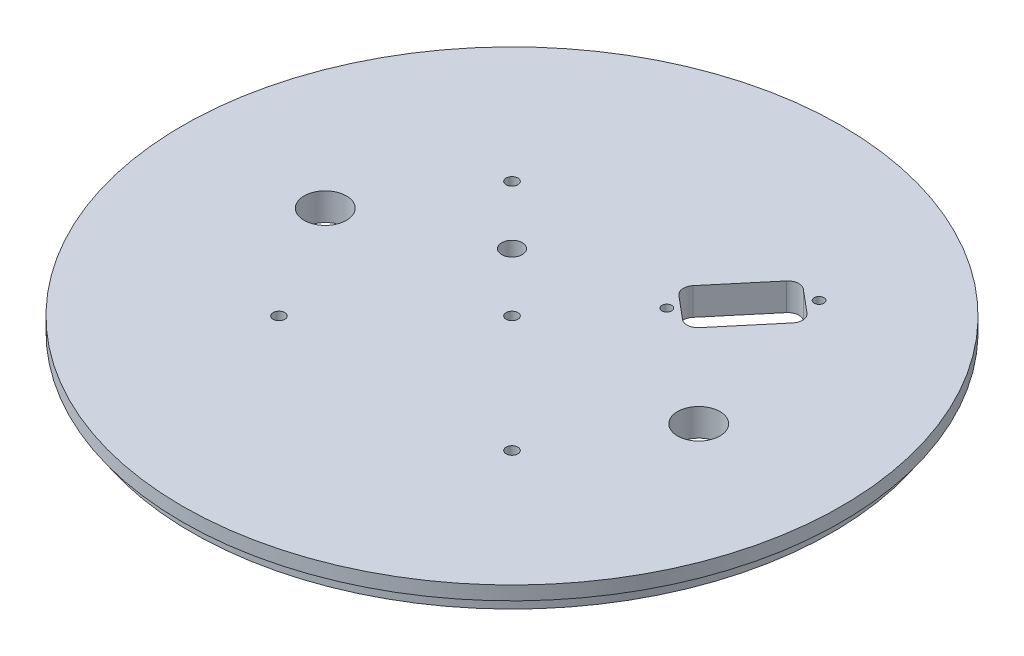
ISO-10303-21;
HEADER;
FILE_DESCRIPTION(('STEP AP214'),'2;1');
FILE_NAME('part.step','',(''),(''),'','','');
FILE_SCHEMA(('AUTOMOTIVE_DESIGN { 1 0 10303 214 1 1 1 1 }'));
ENDSEC;
DATA;
#1=APPLICATION_CONTEXT('core data for automotive mechanical design processes');
#2=APPLICATION_PROTOCOL_DEFINITION('international standard','automotive_design',2000,#1);
#3=PRODUCT_CONTEXT('',#1,'mechanical');
#4=PRODUCT('Part','Part','',(#3));
#5=PRODUCT_RELATED_PRODUCT_CATEGORY('part','',(#4));
#6=PRODUCT_DEFINITION_FORMATION('','',#4);
#7=PRODUCT_DEFINITION_CONTEXT('part definition',#1,'design');
#8=PRODUCT_DEFINITION('design','',#6,#7);
#9=PRODUCT_DEFINITION_SHAPE('','',#8);
#10=(LENGTH_UNIT() NAMED_UNIT(*) SI_UNIT(.MILLI.,.METRE.));
#11=(NAMED_UNIT(*) PLANE_ANGLE_UNIT() SI_UNIT($,.RADIAN.));
#12=(NAMED_UNIT(*) SI_UNIT($,.STERADIAN.) SOLID_ANGLE_UNIT());
#13=UNCERTAINTY_MEASURE_WITH_UNIT(LENGTH_MEASURE(1.E-05),#10,'distance_accuracy_value','');
#14=(GEOMETRIC_REPRESENTATION_CONTEXT(3) GLOBAL_UNCERTAINTY_ASSIGNED_CONTEXT((#13)) GLOBAL_UNIT_ASSIGNED_CONTEXT((#10,
#11,#12)) REPRESENTATION_CONTEXT('',''));
#15=CARTESIAN_POINT('',(0.,0.,0.));
#16=DIRECTION('',(0.,0.,1.));
#17=DIRECTION('',(1.,0.,0.));
#18=AXIS2_PLACEMENT_3D('',#15,#16,#17);
#19=CARTESIAN_POINT('',(0.,0.,0.));
#20=DIRECTION('',(0.,1.,0.));
#21=DIRECTION('',(0.,0.,1.));
#22=AXIS2_PLACEMENT_3D('',#19,#20,#21);
#23=PLANE('',#22);
#24=DIRECTION('',(-0.76604444311898,0.,-0.642787609686537));
#25=VECTOR('',#24,1.);
#26=CARTESIAN_POINT('',(28.300316681429,0.,-39.0615810789514));
#27=LINE('',#26,#25);
#28=CARTESIAN_POINT('',(33.553849472339,0.,-34.6533436517211));
#29=VERTEX_POINT('',#28);
#30=CARTESIAN_POINT('',(28.300316681429,0.,-39.0615810789514));
#31=VERTEX_POINT('',#30);
#32=EDGE_CURVE('E162',#29,#31,#27,.T.);
#33=ORIENTED_EDGE('',*,*,#32,.T.);
#34=CARTESIAN_POINT('',(26.6676361528252,0.,-37.1158281934292));
#35=DIRECTION('',(0.,1.,0.));
#36=DIRECTION('',(0.,0.,-1.));
#37=AXIS2_PLACEMENT_3D('',#34,#35,#36);
#38=CIRCLE('',#37,2.54);
#39=CARTESIAN_POINT('',(24.721883267303,0.,-38.748508722033));
#40=VERTEX_POINT('',#39);
#41=EDGE_CURVE('E155',#31,#40,#38,.T.);
#42=ORIENTED_EDGE('',*,*,#41,.T.);
#43=DIRECTION('',(-0.642787609686538,0.,0.766044443118979));
#44=VECTOR('',#43,1.);
#45=CARTESIAN_POINT('',(14.8563790094081,0.,-26.9912585799332));
#46=LINE('',#45,#44);
#47=CARTESIAN_POINT('',(14.8563790094081,0.,-26.9912585799332));
#48=VERTEX_POINT('',#47);
#49=EDGE_CURVE('E165',#40,#48,#46,.T.);
#50=ORIENTED_EDGE('',*,*,#49,.T.);
#51=CARTESIAN_POINT('',(16.8021318949303,0.,-25.3585780513294));
#52=DIRECTION('',(0.,1.,0.));
#53=DIRECTION('',(0.,0.,1.));
#54=AXIS2_PLACEMENT_3D('',#51,#52,#53);
#55=CIRCLE('',#54,2.54);
#56=CARTESIAN_POINT('',(15.1694513663265,0.,-23.4128251658072));
#57=VERTEX_POINT('',#56);
#58=EDGE_CURVE('E55',#48,#57,#55,.T.);
#59=ORIENTED_EDGE('',*,*,#58,.T.);
#60=DIRECTION('',(0.766044443118979,0.,0.642787609686537));
#61=VECTOR('',#60,1.);
#62=CARTESIAN_POINT('',(15.1694513663265,0.,-23.4128251658072));
#63=LINE('',#62,#61);
#64=CARTESIAN_POINT('',(20.4229841572365,0.,-19.0045877385769));
#65=VERTEX_POINT('',#64);
#66=EDGE_CURVE('E184',#57,#65,#63,.T.);
#67=ORIENTED_EDGE('',*,*,#66,.T.);
#68=CARTESIAN_POINT('',(22.0556646858403,0.,-20.9503406240991));
#69=DIRECTION('',(0.,1.,0.));
#70=DIRECTION('',(0.,0.,1.));
#71=AXIS2_PLACEMENT_3D('',#68,#69,#70);
#72=CIRCLE('',#71,2.54);
#73=CARTESIAN_POINT('',(24.0014175713625,0.,-19.3176600954953));
#74=VERTEX_POINT('',#73);
#75=EDGE_CURVE('E188',#65,#74,#72,.T.);
#76=ORIENTED_EDGE('',*,*,#75,.T.);
#77=DIRECTION('',(0.642787609686538,0.,-0.766044443118979));
#78=VECTOR('',#77,1.);
#79=CARTESIAN_POINT('',(24.0014175713625,0.,-19.3176600954953));
#80=LINE('',#79,#78);
#81=CARTESIAN_POINT('',(33.8669218292574,0.,-31.0749102375951));
#82=VERTEX_POINT('',#81);
#83=EDGE_CURVE('E192',#74,#82,#80,.T.);
#84=ORIENTED_EDGE('',*,*,#83,.T.);
#85=CARTESIAN_POINT('',(31.9211689437352,0.,-32.7075907661989));
#86=DIRECTION('',(0.,1.,0.));
#87=DIRECTION('',(0.,0.,1.));
#88=AXIS2_PLACEMENT_3D('',#85,#86,#87);
#89=CIRCLE('',#88,2.54);
#90=EDGE_CURVE('E196',#82,#29,#89,.T.);
#91=ORIENTED_EDGE('',*,*,#90,.T.);
#92=EDGE_LOOP('',(#33,#42,#50,#59,#67,#76,#84,#91));
#93=FACE_BOUND('',#92,.T.);
#94=CARTESIAN_POINT('',(16.3268052860381,0.,-19.4575288552221));
#95=DIRECTION('',(0.,1.,0.));
#96=DIRECTION('',(0.,0.,1.));
#97=AXIS2_PLACEMENT_3D('',#94,#95,#96);
#98=CIRCLE('',#97,1.1303);
#99=CARTESIAN_POINT('',(16.3268052860381,0.,-18.3272288552221));
#100=VERTEX_POINT('',#99);
#101=EDGE_CURVE('E249',#100,#100,#98,.T.);
#102=ORIENTED_EDGE('',*,*,#101,.T.);
#103=EDGE_LOOP('',(#102));
#104=FACE_BOUND('',#103,.T.);
#105=CARTESIAN_POINT('',(32.3964955526274,0.,-38.6086399623062));
#106=DIRECTION('',(0.,1.,0.));
#107=DIRECTION('',(0.,0.,1.));
#108=AXIS2_PLACEMENT_3D('',#105,#106,#107);
#109=CIRCLE('',#108,1.1303);
#110=CARTESIAN_POINT('',(32.3964955526274,0.,-37.4783399623062));
#111=VERTEX_POINT('',#110);
#112=EDGE_CURVE('E257',#111,#111,#109,.T.);
#113=ORIENTED_EDGE('',*,*,#112,.T.);
#114=EDGE_LOOP('',(#113));
#115=FACE_BOUND('',#114,.T.);
#116=DIRECTION('',(0.,0.,-1.));
#117=VECTOR('',#116,1.);
#118=CARTESIAN_POINT('',(3.23850000000001,0.,0.));
#119=LINE('',#118,#117);
#120=CARTESIAN_POINT('',(3.23850000000001,0.,-13.97));
#121=VERTEX_POINT('',#120);
#122=CARTESIAN_POINT('',(3.23850000000001,0.,-34.798));
#123=VERTEX_POINT('',#122);
#124=EDGE_CURVE('E48',#121,#123,#119,.T.);
#125=ORIENTED_EDGE('',*,*,#124,.T.);
#126=CARTESIAN_POINT('',(0.,0.,-34.798));
#127=DIRECTION('',(0.,1.,0.));
#128=DIRECTION('',(0.,0.,1.));
#129=AXIS2_PLACEMENT_3D('',#126,#127,#128);
#130=CIRCLE('',#129,3.2385);
#131=CARTESIAN_POINT('',(-3.23849999999999,0.,-34.798));
#132=VERTEX_POINT('',#131);
#133=EDGE_CURVE('E11',#123,#132,#130,.T.);
#134=ORIENTED_EDGE('',*,*,#133,.T.);
#135=DIRECTION('',(0.,0.,1.));
#136=VECTOR('',#135,1.);
#137=CARTESIAN_POINT('',(-3.23849999999999,0.,0.));
#138=LINE('',#137,#136);
#139=CARTESIAN_POINT('',(-3.23849999999999,0.,-13.97));
#140=VERTEX_POINT('',#139);
#141=EDGE_CURVE('E405',#132,#140,#138,.T.);
#142=ORIENTED_EDGE('',*,*,#141,.T.);
#143=CARTESIAN_POINT('',(0.,0.,-13.97));
#144=DIRECTION('',(0.,1.,0.));
#145=DIRECTION('',(0.,0.,1.));
#146=AXIS2_PLACEMENT_3D('',#143,#144,#145);
#147=CIRCLE('',#146,3.2385);
#148=EDGE_CURVE('E409',#140,#121,#147,.T.);
#149=ORIENTED_EDGE('',*,*,#148,.T.);
#150=EDGE_LOOP('',(#125,#134,#142,#149));
#151=FACE_BOUND('',#150,.T.);
#152=DIRECTION('',(0.,0.,1.));
#153=VECTOR('',#152,1.);
#154=CARTESIAN_POINT('',(-3.23850000000005,0.,0.));
#155=LINE('',#154,#153);
#156=CARTESIAN_POINT('',(-3.23850000000005,0.,13.97));
#157=VERTEX_POINT('',#156);
#158=CARTESIAN_POINT('',(-3.23850000000005,0.,34.798));
#159=VERTEX_POINT('',#158);
#160=EDGE_CURVE('E397',#157,#159,#155,.T.);
#161=ORIENTED_EDGE('',*,*,#160,.T.);
#162=CARTESIAN_POINT('',(0.,0.,34.798));
#163=DIRECTION('',(0.,1.,0.));
#164=DIRECTION('',(0.,0.,1.));
#165=AXIS2_PLACEMENT_3D('',#162,#163,#164);
#166=CIRCLE('',#165,3.2385);
#167=CARTESIAN_POINT('',(3.23849999999995,0.,34.798));
#168=VERTEX_POINT('',#167);
#169=EDGE_CURVE('E401',#159,#168,#166,.T.);
#170=ORIENTED_EDGE('',*,*,#169,.T.);
#171=DIRECTION('',(0.,0.,-1.));
#172=VECTOR('',#171,1.);
#173=CARTESIAN_POINT('',(3.23849999999995,0.,0.));
#174=LINE('',#173,#172);
#175=CARTESIAN_POINT('',(3.23849999999995,0.,13.97));
#176=VERTEX_POINT('',#175);
#177=EDGE_CURVE('E389',#168,#176,#174,.T.);
#178=ORIENTED_EDGE('',*,*,#177,.T.);
#179=CARTESIAN_POINT('',(0.,0.,13.97));
#180=DIRECTION('',(0.,1.,0.));
#181=DIRECTION('',(0.,0.,1.));
#182=AXIS2_PLACEMENT_3D('',#179,#180,#181);
#183=CIRCLE('',#182,3.2385);
#184=EDGE_CURVE('E393',#176,#157,#183,.T.);
#185=ORIENTED_EDGE('',*,*,#184,.T.);
#186=EDGE_LOOP('',(#161,#170,#178,#185));
#187=FACE_BOUND('',#186,.T.);
#188=CARTESIAN_POINT('',(0.,0.,0.));
#189=DIRECTION('',(0.,1.,0.));
#190=DIRECTION('',(0.,0.,1.));
#191=AXIS2_PLACEMENT_3D('',#188,#189,#190);
#192=CIRCLE('',#191,1.3589);
#193=CARTESIAN_POINT('',(0.,0.,1.3589));
#194=VERTEX_POINT('',#193);
#195=EDGE_CURVE('E329',#194,#194,#192,.T.);
#196=ORIENTED_EDGE('',*,*,#195,.T.);
#197=EDGE_LOOP('',(#196));
#198=FACE_BOUND('',#197,.T.);
#199=CARTESIAN_POINT('',(-26.9407683632074,0.,26.9407683632075));
#200=DIRECTION('',(0.,1.,0.));
#201=DIRECTION('',(0.,0.,1.));
#202=AXIS2_PLACEMENT_3D('',#199,#200,#201);
#203=CIRCLE('',#202,1.3589);
#204=CARTESIAN_POINT('',(-26.9407683632074,0.,28.2996683632075));
#205=VERTEX_POINT('',#204);
#206=EDGE_CURVE('E334',#205,#205,#203,.T.);
#207=ORIENTED_EDGE('',*,*,#206,.T.);
#208=EDGE_LOOP('',(#207));
#209=FACE_BOUND('',#208,.T.);
#210=CARTESIAN_POINT('',(-13.4703841816037,0.,-13.4703841816038));
#211=DIRECTION('',(0.,1.,0.));
#212=DIRECTION('',(0.,0.,1.));
#213=AXIS2_PLACEMENT_3D('',#210,#211,#212);
#214=CIRCLE('',#213,2.38125);
#215=CARTESIAN_POINT('',(-13.4703841816037,0.,-11.0891341816038));
#216=VERTEX_POINT('',#215);
#217=EDGE_CURVE('E342',#216,#216,#214,.T.);
#218=ORIENTED_EDGE('',*,*,#217,.T.);
#219=EDGE_LOOP('',(#218));
#220=FACE_BOUND('',#219,.T.);
#221=CARTESIAN_POINT('',(26.9407683632076,0.,26.9407683632073));
#222=DIRECTION('',(0.,1.,0.));
#223=DIRECTION('',(0.,0.,-1.));
#224=AXIS2_PLACEMENT_3D('',#221,#222,#223);
#225=CIRCLE('',#224,1.3589);
#226=CARTESIAN_POINT('',(26.9407683632076,0.,25.5818683632073));
#227=VERTEX_POINT('',#226);
#228=EDGE_CURVE('E350',#227,#227,#225,.T.);
#229=ORIENTED_EDGE('',*,*,#228,.T.);
#230=EDGE_LOOP('',(#229));
#231=FACE_BOUND('',#230,.T.);
#232=CARTESIAN_POINT('',(-26.9407683632074,0.,-26.9407683632075));
#233=DIRECTION('',(0.,1.,0.));
#234=DIRECTION('',(0.,0.,1.));
#235=AXIS2_PLACEMENT_3D('',#232,#233,#234);
#236=CIRCLE('',#235,1.3589);
#237=CARTESIAN_POINT('',(-26.9407683632074,0.,-25.5818683632075));
#238=VERTEX_POINT('',#237);
#239=EDGE_CURVE('E358',#238,#238,#236,.T.);
#240=ORIENTED_EDGE('',*,*,#239,.T.);
#241=EDGE_LOOP('',(#240));
#242=FACE_BOUND('',#241,.T.);
#243=CARTESIAN_POINT('',(-43.18,0.,0.));
#244=DIRECTION('',(0.,1.,0.));
#245=DIRECTION('',(0.,0.,-1.));
#246=AXIS2_PLACEMENT_3D('',#243,#244,#245);
#247=CIRCLE('',#246,4.9022);
#248=CARTESIAN_POINT('',(-43.18,0.,-4.9022));
#249=VERTEX_POINT('',#248);
#250=EDGE_CURVE('E366',#249,#249,#247,.T.);
#251=ORIENTED_EDGE('',*,*,#250,.T.);
#252=EDGE_LOOP('',(#251));
#253=FACE_BOUND('',#252,.T.);
#254=CARTESIAN_POINT('',(43.18,0.,0.));
#255=DIRECTION('',(0.,1.,0.));
#256=DIRECTION('',(0.,0.,1.));
#257=AXIS2_PLACEMENT_3D('',#254,#255,#256);
#258=CIRCLE('',#257,4.9022);
#259=CARTESIAN_POINT('',(43.18,0.,4.9022));
#260=VERTEX_POINT('',#259);
#261=EDGE_CURVE('E374',#260,#260,#258,.T.);
#262=ORIENTED_EDGE('',*,*,#261,.T.);
#263=EDGE_LOOP('',(#262));
#264=FACE_BOUND('',#263,.T.);
#265=CARTESIAN_POINT('',(0.,0.,0.));
#266=DIRECTION('',(0.,-1.,0.));
#267=DIRECTION('',(0.,0.,-1.));
#268=AXIS2_PLACEMENT_3D('',#265,#266,#267);
#269=CIRCLE('',#268,74.041);
#270=CARTESIAN_POINT('',(0.,0.,-74.041));
#271=VERTEX_POINT('',#270);
#272=EDGE_CURVE('E283',#271,#271,#269,.T.);
#273=ORIENTED_EDGE('',*,*,#272,.T.);
#274=EDGE_LOOP('',(#273));
#275=FACE_BOUND('',#274,.T.);
#276=ADVANCED_FACE('F39',(#93,#104,#115,#151,#187,#198,#209,#220,#231,#242,#253,#264,#275),#23,.F.);
#277=CARTESIAN_POINT('',(0.,6.35,0.));
#278=DIRECTION('',(0.,-1.,0.));
#279=DIRECTION('',(0.,0.,-1.));
#280=AXIS2_PLACEMENT_3D('',#277,#278,#279);
#281=CYLINDRICAL_SURFACE('',#280,76.2);
#282=CARTESIAN_POINT('',(0.,6.35,0.));
#283=DIRECTION('',(0.,1.,0.));
#284=DIRECTION('',(0.,0.,1.));
#285=AXIS2_PLACEMENT_3D('',#282,#283,#284);
#286=CIRCLE('',#285,76.2);
#287=CARTESIAN_POINT('',(0.,6.35,76.2));
#288=VERTEX_POINT('',#287);
#289=EDGE_CURVE('E382',#288,#288,#286,.T.);
#290=ORIENTED_EDGE('',*,*,#289,.F.);
#291=EDGE_LOOP('',(#290));
#292=FACE_BOUND('',#291,.T.);
#293=CARTESIAN_POINT('',(0.,3.175,0.));
#294=DIRECTION('',(0.,-1.,0.));
#295=DIRECTION('',(0.,0.,-1.));
#296=AXIS2_PLACEMENT_3D('',#293,#294,#295);
#297=CIRCLE('',#296,76.2);
#298=CARTESIAN_POINT('',(0.,3.175,-76.2));
#299=VERTEX_POINT('',#298);
#300=EDGE_CURVE('E322',#299,#299,#297,.T.);
#301=ORIENTED_EDGE('',*,*,#300,.F.);
#302=EDGE_LOOP('',(#301));
#303=FACE_BOUND('',#302,.T.);
#304=ADVANCED_FACE('F41',(#292,#303),#281,.T.);
#305=CARTESIAN_POINT('',(0.,6.35,0.));
#306=DIRECTION('',(0.,1.,0.));
#307=DIRECTION('',(0.,0.,1.));
#308=AXIS2_PLACEMENT_3D('',#305,#306,#307);
#309=PLANE('',#308);
#310=CARTESIAN_POINT('',(26.6676361528252,6.35,-37.1158281934292));
#311=DIRECTION('',(0.,1.,0.));
#312=DIRECTION('',(0.,0.,-1.));
#313=AXIS2_PLACEMENT_3D('',#310,#311,#312);
#314=CIRCLE('',#313,2.54);
#315=CARTESIAN_POINT('',(28.300316681429,6.35,-39.0615810789514));
#316=VERTEX_POINT('',#315);
#317=CARTESIAN_POINT('',(24.721883267303,6.35,-38.748508722033));
#318=VERTEX_POINT('',#317);
#319=EDGE_CURVE('E63',#316,#318,#314,.T.);
#320=ORIENTED_EDGE('',*,*,#319,.F.);
#321=DIRECTION('',(-0.76604444311898,0.,-0.642787609686537));
#322=VECTOR('',#321,1.);
#323=CARTESIAN_POINT('',(28.300316681429,6.35,-39.0615810789514));
#324=LINE('',#323,#322);
#325=CARTESIAN_POINT('',(33.553849472339,6.35,-34.6533436517211));
#326=VERTEX_POINT('',#325);
#327=EDGE_CURVE('E174',#326,#316,#324,.T.);
#328=ORIENTED_EDGE('',*,*,#327,.F.);
#329=CARTESIAN_POINT('',(31.9211689437352,6.35,-32.7075907661989));
#330=DIRECTION('',(0.,1.,0.));
#331=DIRECTION('',(0.,0.,1.));
#332=AXIS2_PLACEMENT_3D('',#329,#330,#331);
#333=CIRCLE('',#332,2.54);
#334=CARTESIAN_POINT('',(33.8669218292574,6.35,-31.0749102375951));
#335=VERTEX_POINT('',#334);
#336=EDGE_CURVE('E179',#335,#326,#333,.T.);
#337=ORIENTED_EDGE('',*,*,#336,.F.);
#338=DIRECTION('',(0.642787609686538,0.,-0.766044443118979));
#339=VECTOR('',#338,1.);
#340=CARTESIAN_POINT('',(24.0014175713625,6.35,-19.3176600954953));
#341=LINE('',#340,#339);
#342=CARTESIAN_POINT('',(24.0014175713625,6.35,-19.3176600954953));
#343=VERTEX_POINT('',#342);
#344=EDGE_CURVE('E218',#343,#335,#341,.T.);
#345=ORIENTED_EDGE('',*,*,#344,.F.);
#346=CARTESIAN_POINT('',(22.0556646858403,6.35,-20.9503406240991));
#347=DIRECTION('',(0.,1.,0.));
#348=DIRECTION('',(0.,0.,1.));
#349=AXIS2_PLACEMENT_3D('',#346,#347,#348);
#350=CIRCLE('',#349,2.54);
#351=CARTESIAN_POINT('',(20.4229841572365,6.35,-19.0045877385769));
#352=VERTEX_POINT('',#351);
#353=EDGE_CURVE('E214',#352,#343,#350,.T.);
#354=ORIENTED_EDGE('',*,*,#353,.F.);
#355=DIRECTION('',(0.766044443118979,0.,0.642787609686537));
#356=VECTOR('',#355,1.);
#357=CARTESIAN_POINT('',(15.1694513663265,6.35,-23.4128251658072));
#358=LINE('',#357,#356);
#359=CARTESIAN_POINT('',(15.1694513663265,6.35,-23.4128251658072));
#360=VERTEX_POINT('',#359);
#361=EDGE_CURVE('E210',#360,#352,#358,.T.);
#362=ORIENTED_EDGE('',*,*,#361,.F.);
#363=CARTESIAN_POINT('',(16.8021318949303,6.35,-25.3585780513294));
#364=DIRECTION('',(0.,1.,0.));
#365=DIRECTION('',(0.,0.,1.));
#366=AXIS2_PLACEMENT_3D('',#363,#364,#365);
#367=CIRCLE('',#366,2.54);
#368=CARTESIAN_POINT('',(14.8563790094081,6.35,-26.9912585799332));
#369=VERTEX_POINT('',#368);
#370=EDGE_CURVE('E206',#369,#360,#367,.T.);
#371=ORIENTED_EDGE('',*,*,#370,.F.);
#372=DIRECTION('',(-0.642787609686538,0.,0.766044443118979));
#373=VECTOR('',#372,1.);
#374=CARTESIAN_POINT('',(14.8563790094081,6.35,-26.9912585799332));
#375=LINE('',#374,#373);
#376=EDGE_CURVE('E203',#318,#369,#375,.T.);
#377=ORIENTED_EDGE('',*,*,#376,.F.);
#378=EDGE_LOOP('',(#320,#328,#337,#345,#354,#362,#371,#377));
#379=FACE_BOUND('',#378,.T.);
#380=CARTESIAN_POINT('',(16.3268052860381,6.35,-19.4575288552221));
#381=DIRECTION('',(0.,1.,0.));
#382=DIRECTION('',(0.,0.,1.));
#383=AXIS2_PLACEMENT_3D('',#380,#381,#382);
#384=CIRCLE('',#383,1.1303);
#385=CARTESIAN_POINT('',(16.3268052860381,6.35,-18.3272288552221));
#386=VERTEX_POINT('',#385);
#387=EDGE_CURVE('E228',#386,#386,#384,.T.);
#388=ORIENTED_EDGE('',*,*,#387,.F.);
#389=EDGE_LOOP('',(#388));
#390=FACE_BOUND('',#389,.T.);
#391=CARTESIAN_POINT('',(32.3964955526274,6.35,-38.6086399623062));
#392=DIRECTION('',(0.,1.,0.));
#393=DIRECTION('',(0.,0.,1.));
#394=AXIS2_PLACEMENT_3D('',#391,#392,#393);
#395=CIRCLE('',#394,1.1303);
#396=CARTESIAN_POINT('',(32.3964955526274,6.35,-37.4783399623062));
#397=VERTEX_POINT('',#396);
#398=EDGE_CURVE('E253',#397,#397,#395,.T.);
#399=ORIENTED_EDGE('',*,*,#398,.F.);
#400=EDGE_LOOP('',(#399));
#401=FACE_BOUND('',#400,.T.);
#402=CARTESIAN_POINT('',(-26.9407683632074,6.35,26.9407683632075));
#403=DIRECTION('',(0.,1.,0.));
#404=DIRECTION('',(0.,0.,1.));
#405=AXIS2_PLACEMENT_3D('',#402,#403,#404);
#406=CIRCLE('',#405,1.3589);
#407=CARTESIAN_POINT('',(-26.9407683632074,6.35,28.2996683632075));
#408=VERTEX_POINT('',#407);
#409=EDGE_CURVE('E338',#408,#408,#406,.T.);
#410=ORIENTED_EDGE('',*,*,#409,.F.);
#411=EDGE_LOOP('',(#410));
#412=FACE_BOUND('',#411,.T.);
#413=CARTESIAN_POINT('',(26.9407683632076,6.35,26.9407683632073));
#414=DIRECTION('',(0.,1.,0.));
#415=DIRECTION('',(0.,0.,-1.));
#416=AXIS2_PLACEMENT_3D('',#413,#414,#415);
#417=CIRCLE('',#416,1.3589);
#418=CARTESIAN_POINT('',(26.9407683632076,6.35,25.5818683632073));
#419=VERTEX_POINT('',#418);
#420=EDGE_CURVE('E354',#419,#419,#417,.T.);
#421=ORIENTED_EDGE('',*,*,#420,.F.);
#422=EDGE_LOOP('',(#421));
#423=FACE_BOUND('',#422,.T.);
#424=CARTESIAN_POINT('',(-43.18,6.35,0.));
#425=DIRECTION('',(0.,1.,0.));
#426=DIRECTION('',(0.,0.,-1.));
#427=AXIS2_PLACEMENT_3D('',#424,#425,#426);
#428=CIRCLE('',#427,4.9022);
#429=CARTESIAN_POINT('',(-43.18,6.35,-4.9022));
#430=VERTEX_POINT('',#429);
#431=EDGE_CURVE('E370',#430,#430,#428,.T.);
#432=ORIENTED_EDGE('',*,*,#431,.F.);
#433=EDGE_LOOP('',(#432));
#434=FACE_BOUND('',#433,.T.);
#435=ORIENTED_EDGE('',*,*,#289,.T.);
#436=EDGE_LOOP('',(#435));
#437=FACE_BOUND('',#436,.T.);
#438=CARTESIAN_POINT('',(43.18,6.35,0.));
#439=DIRECTION('',(0.,1.,0.));
#440=DIRECTION('',(0.,0.,1.));
#441=AXIS2_PLACEMENT_3D('',#438,#439,#440);
#442=CIRCLE('',#441,4.9022);
#443=CARTESIAN_POINT('',(43.18,6.35,4.9022));
#444=VERTEX_POINT('',#443);
#445=EDGE_CURVE('E378',#444,#444,#442,.T.);
#446=ORIENTED_EDGE('',*,*,#445,.F.);
#447=EDGE_LOOP('',(#446));
#448=FACE_BOUND('',#447,.T.);
#449=CARTESIAN_POINT('',(-26.9407683632074,6.35,-26.9407683632075));
#450=DIRECTION('',(0.,1.,0.));
#451=DIRECTION('',(0.,0.,1.));
#452=AXIS2_PLACEMENT_3D('',#449,#450,#451);
#453=CIRCLE('',#452,1.3589);
#454=CARTESIAN_POINT('',(-26.9407683632074,6.35,-25.5818683632075));
#455=VERTEX_POINT('',#454);
#456=EDGE_CURVE('E362',#455,#455,#453,.T.);
#457=ORIENTED_EDGE('',*,*,#456,.F.);
#458=EDGE_LOOP('',(#457));
#459=FACE_BOUND('',#458,.T.);
#460=CARTESIAN_POINT('',(-13.4703841816037,6.35,-13.4703841816038));
#461=DIRECTION('',(0.,1.,0.));
#462=DIRECTION('',(0.,0.,1.));
#463=AXIS2_PLACEMENT_3D('',#460,#461,#462);
#464=CIRCLE('',#463,2.38125);
#465=CARTESIAN_POINT('',(-13.4703841816037,6.35,-11.0891341816038));
#466=VERTEX_POINT('',#465);
#467=EDGE_CURVE('E346',#466,#466,#464,.T.);
#468=ORIENTED_EDGE('',*,*,#467,.F.);
#469=EDGE_LOOP('',(#468));
#470=FACE_BOUND('',#469,.T.);
#471=CARTESIAN_POINT('',(0.,6.35,0.));
#472=DIRECTION('',(0.,1.,0.));
#473=DIRECTION('',(0.,0.,1.));
#474=AXIS2_PLACEMENT_3D('',#471,#472,#473);
#475=CIRCLE('',#474,1.3589);
#476=CARTESIAN_POINT('',(0.,6.35,1.3589));
#477=VERTEX_POINT('',#476);
#478=EDGE_CURVE('E330',#477,#477,#475,.T.);
#479=ORIENTED_EDGE('',*,*,#478,.F.);
#480=EDGE_LOOP('',(#479));
#481=FACE_BOUND('',#480,.T.);
#482=ADVANCED_FACE('F449',(#379,#390,#401,#412,#423,#434,#437,#448,#459,#470,#481),#309,.T.);
#483=CARTESIAN_POINT('',(43.18,6.35,0.));
#484=DIRECTION('',(0.,-1.,0.));
#485=DIRECTION('',(0.,0.,-1.));
#486=AXIS2_PLACEMENT_3D('',#483,#484,#485);
#487=CYLINDRICAL_SURFACE('',#486,4.9022);
#488=ORIENTED_EDGE('',*,*,#445,.T.);
#489=EDGE_LOOP('',(#488));
#490=FACE_BOUND('',#489,.T.);
#491=ORIENTED_EDGE('',*,*,#261,.F.);
#492=EDGE_LOOP('',(#491));
#493=FACE_BOUND('',#492,.T.);
#494=ADVANCED_FACE('F454',(#490,#493),#487,.F.);
#495=CARTESIAN_POINT('',(-43.18,6.35,0.));
#496=DIRECTION('',(0.,-1.,0.));
#497=DIRECTION('',(0.,0.,-1.));
#498=AXIS2_PLACEMENT_3D('',#495,#496,#497);
#499=CYLINDRICAL_SURFACE('',#498,4.9022);
#500=ORIENTED_EDGE('',*,*,#431,.T.);
#501=EDGE_LOOP('',(#500));
#502=FACE_BOUND('',#501,.T.);
#503=ORIENTED_EDGE('',*,*,#250,.F.);
#504=EDGE_LOOP('',(#503));
#505=FACE_BOUND('',#504,.T.);
#506=ADVANCED_FACE('F458',(#502,#505),#499,.F.);
#507=CARTESIAN_POINT('',(-26.9407683632074,6.35,-26.9407683632075));
#508=DIRECTION('',(0.,-1.,0.));
#509=DIRECTION('',(0.,0.,-1.));
#510=AXIS2_PLACEMENT_3D('',#507,#508,#509);
#511=CYLINDRICAL_SURFACE('',#510,1.3589);
#512=ORIENTED_EDGE('',*,*,#456,.T.);
#513=EDGE_LOOP('',(#512));
#514=FACE_BOUND('',#513,.T.);
#515=ORIENTED_EDGE('',*,*,#239,.F.);
#516=EDGE_LOOP('',(#515));
#517=FACE_BOUND('',#516,.T.);
#518=ADVANCED_FACE('F462',(#514,#517),#511,.F.);
#519=CARTESIAN_POINT('',(26.9407683632076,6.35,26.9407683632073));
#520=DIRECTION('',(0.,-1.,0.));
#521=DIRECTION('',(0.,0.,-1.));
#522=AXIS2_PLACEMENT_3D('',#519,#520,#521);
#523=CYLINDRICAL_SURFACE('',#522,1.3589);
#524=ORIENTED_EDGE('',*,*,#420,.T.);
#525=EDGE_LOOP('',(#524));
#526=FACE_BOUND('',#525,.T.);
#527=ORIENTED_EDGE('',*,*,#228,.F.);
#528=EDGE_LOOP('',(#527));
#529=FACE_BOUND('',#528,.T.);
#530=ADVANCED_FACE('F466',(#526,#529),#523,.F.);
#531=CARTESIAN_POINT('',(-13.4703841816037,6.35,-13.4703841816038));
#532=DIRECTION('',(0.,-1.,0.));
#533=DIRECTION('',(0.,0.,-1.));
#534=AXIS2_PLACEMENT_3D('',#531,#532,#533);
#535=CYLINDRICAL_SURFACE('',#534,2.38125);
#536=ORIENTED_EDGE('',*,*,#467,.T.);
#537=EDGE_LOOP('',(#536));
#538=FACE_BOUND('',#537,.T.);
#539=ORIENTED_EDGE('',*,*,#217,.F.);
#540=EDGE_LOOP('',(#539));
#541=FACE_BOUND('',#540,.T.);
#542=ADVANCED_FACE('F470',(#538,#541),#535,.F.);
#543=CARTESIAN_POINT('',(-26.9407683632074,6.35,26.9407683632075));
#544=DIRECTION('',(0.,-1.,0.));
#545=DIRECTION('',(0.,0.,-1.));
#546=AXIS2_PLACEMENT_3D('',#543,#544,#545);
#547=CYLINDRICAL_SURFACE('',#546,1.3589);
#548=ORIENTED_EDGE('',*,*,#409,.T.);
#549=EDGE_LOOP('',(#548));
#550=FACE_BOUND('',#549,.T.);
#551=ORIENTED_EDGE('',*,*,#206,.F.);
#552=EDGE_LOOP('',(#551));
#553=FACE_BOUND('',#552,.T.);
#554=ADVANCED_FACE('F474',(#550,#553),#547,.F.);
#555=CARTESIAN_POINT('',(0.,6.35,0.));
#556=DIRECTION('',(0.,-1.,0.));
#557=DIRECTION('',(0.,0.,-1.));
#558=AXIS2_PLACEMENT_3D('',#555,#556,#557);
#559=CYLINDRICAL_SURFACE('',#558,1.3589);
#560=ORIENTED_EDGE('',*,*,#478,.T.);
#561=EDGE_LOOP('',(#560));
#562=FACE_BOUND('',#561,.T.);
#563=ORIENTED_EDGE('',*,*,#195,.F.);
#564=EDGE_LOOP('',(#563));
#565=FACE_BOUND('',#564,.T.);
#566=ADVANCED_FACE('F478',(#562,#565),#559,.F.);
#567=CARTESIAN_POINT('',(0.,3.175,0.));
#568=DIRECTION('',(0.,-1.,0.));
#569=DIRECTION('',(0.,0.,-1.));
#570=AXIS2_PLACEMENT_3D('',#567,#568,#569);
#571=PLANE('',#570);
#572=CARTESIAN_POINT('',(0.,3.175,0.));
#573=DIRECTION('',(0.,-1.,0.));
#574=DIRECTION('',(0.,0.,-1.));
#575=AXIS2_PLACEMENT_3D('',#572,#573,#574);
#576=CIRCLE('',#575,74.041);
#577=CARTESIAN_POINT('',(0.,3.175,-74.041));
#578=VERTEX_POINT('',#577);
#579=EDGE_CURVE('E318',#578,#578,#576,.T.);
#580=ORIENTED_EDGE('',*,*,#579,.F.);
#581=EDGE_LOOP('',(#580));
#582=FACE_BOUND('',#581,.T.);
#583=ORIENTED_EDGE('',*,*,#300,.T.);
#584=EDGE_LOOP('',(#583));
#585=FACE_BOUND('',#584,.T.);
#586=ADVANCED_FACE('F482',(#582,#585),#571,.T.);
#587=CARTESIAN_POINT('',(0.,3.175,0.));
#588=DIRECTION('',(0.,-1.,0.));
#589=DIRECTION('',(0.,0.,-1.));
#590=AXIS2_PLACEMENT_3D('',#587,#588,#589);
#591=CYLINDRICAL_SURFACE('',#590,74.041);
#592=ORIENTED_EDGE('',*,*,#579,.T.);
#593=EDGE_LOOP('',(#592));
#594=FACE_BOUND('',#593,.T.);
#595=ORIENTED_EDGE('',*,*,#272,.F.);
#596=EDGE_LOOP('',(#595));
#597=FACE_BOUND('',#596,.T.);
#598=ADVANCED_FACE('F486',(#594,#597),#591,.T.);
#599=CARTESIAN_POINT('',(0.,-0.381,34.798));
#600=DIRECTION('',(0.,1.,0.));
#601=DIRECTION('',(0.,0.,1.));
#602=AXIS2_PLACEMENT_3D('',#599,#600,#601);
#603=CYLINDRICAL_SURFACE('',#602,3.2385);
#604=DIRECTION('',(0.,1.,0.));
#605=VECTOR('',#604,1.);
#606=CARTESIAN_POINT('',(-3.23850000000005,-0.381,34.798));
#607=LINE('',#606,#605);
#608=CARTESIAN_POINT('',(-3.23850000000005,3.175,34.798));
#609=VERTEX_POINT('',#608);
#610=EDGE_CURVE('E267',#159,#609,#607,.T.);
#611=ORIENTED_EDGE('',*,*,#610,.T.);
#612=CARTESIAN_POINT('',(0.,3.175,34.798));
#613=DIRECTION('',(0.,1.,0.));
#614=DIRECTION('',(0.,0.,-1.));
#615=AXIS2_PLACEMENT_3D('',#612,#613,#614);
#616=CIRCLE('',#615,3.2385);
#617=CARTESIAN_POINT('',(3.23849999999995,3.175,34.798));
#618=VERTEX_POINT('',#617);
#619=EDGE_CURVE('E261',#609,#618,#616,.T.);
#620=ORIENTED_EDGE('',*,*,#619,.T.);
#621=DIRECTION('',(0.,1.,0.));
#622=VECTOR('',#621,1.);
#623=CARTESIAN_POINT('',(3.23849999999995,-0.381,34.798));
#624=LINE('',#623,#622);
#625=EDGE_CURVE('E307',#168,#618,#624,.T.);
#626=ORIENTED_EDGE('',*,*,#625,.F.);
#627=ORIENTED_EDGE('',*,*,#169,.F.);
#628=EDGE_LOOP('',(#611,#620,#626,#627));
#629=FACE_BOUND('',#628,.T.);
#630=ADVANCED_FACE('F490',(#629),#603,.F.);
#631=CARTESIAN_POINT('',(-3.23850000000005,-0.381,34.798));
#632=DIRECTION('',(-1.,0.,0.));
#633=DIRECTION('',(0.,0.,1.));
#634=AXIS2_PLACEMENT_3D('',#631,#632,#633);
#635=PLANE('',#634);
#636=DIRECTION('',(0.,1.,0.));
#637=VECTOR('',#636,1.);
#638=CARTESIAN_POINT('',(-3.23850000000005,-0.381,13.97));
#639=LINE('',#638,#637);
#640=CARTESIAN_POINT('',(-3.23850000000005,3.175,13.97));
#641=VERTEX_POINT('',#640);
#642=EDGE_CURVE('E310',#157,#641,#639,.T.);
#643=ORIENTED_EDGE('',*,*,#642,.T.);
#644=DIRECTION('',(0.,0.,1.));
#645=VECTOR('',#644,1.);
#646=CARTESIAN_POINT('',(-3.23850000000005,3.175,34.798));
#647=LINE('',#646,#645);
#648=EDGE_CURVE('E303',#641,#609,#647,.T.);
#649=ORIENTED_EDGE('',*,*,#648,.T.);
#650=ORIENTED_EDGE('',*,*,#610,.F.);
#651=ORIENTED_EDGE('',*,*,#160,.F.);
#652=EDGE_LOOP('',(#643,#649,#650,#651));
#653=FACE_BOUND('',#652,.T.);
#654=ADVANCED_FACE('F494',(#653),#635,.F.);
#655=CARTESIAN_POINT('',(0.,-0.381,13.97));
#656=DIRECTION('',(0.,1.,0.));
#657=DIRECTION('',(0.,0.,1.));
#658=AXIS2_PLACEMENT_3D('',#655,#656,#657);
#659=CYLINDRICAL_SURFACE('',#658,3.2385);
#660=DIRECTION('',(0.,1.,0.));
#661=VECTOR('',#660,1.);
#662=CARTESIAN_POINT('',(3.23849999999995,-0.381,13.97));
#663=LINE('',#662,#661);
#664=CARTESIAN_POINT('',(3.23849999999995,3.175,13.97));
#665=VERTEX_POINT('',#664);
#666=EDGE_CURVE('E313',#176,#665,#663,.T.);
#667=ORIENTED_EDGE('',*,*,#666,.T.);
#668=CARTESIAN_POINT('',(0.,3.175,13.97));
#669=DIRECTION('',(0.,1.,0.));
#670=DIRECTION('',(0.,0.,-1.));
#671=AXIS2_PLACEMENT_3D('',#668,#669,#670);
#672=CIRCLE('',#671,3.2385);
#673=EDGE_CURVE('E299',#665,#641,#672,.T.);
#674=ORIENTED_EDGE('',*,*,#673,.T.);
#675=ORIENTED_EDGE('',*,*,#642,.F.);
#676=ORIENTED_EDGE('',*,*,#184,.F.);
#677=EDGE_LOOP('',(#667,#674,#675,#676));
#678=FACE_BOUND('',#677,.T.);
#679=ADVANCED_FACE('F500',(#678),#659,.F.);
#680=CARTESIAN_POINT('',(3.23849999999995,-0.381,34.798));
#681=DIRECTION('',(1.,0.,0.));
#682=DIRECTION('',(0.,0.,-1.));
#683=AXIS2_PLACEMENT_3D('',#680,#681,#682);
#684=PLANE('',#683);
#685=ORIENTED_EDGE('',*,*,#625,.T.);
#686=DIRECTION('',(0.,0.,-1.));
#687=VECTOR('',#686,1.);
#688=CARTESIAN_POINT('',(3.23849999999995,3.175,34.798));
#689=LINE('',#688,#687);
#690=EDGE_CURVE('E295',#618,#665,#689,.T.);
#691=ORIENTED_EDGE('',*,*,#690,.T.);
#692=ORIENTED_EDGE('',*,*,#666,.F.);
#693=ORIENTED_EDGE('',*,*,#177,.F.);
#694=EDGE_LOOP('',(#685,#691,#692,#693));
#695=FACE_BOUND('',#694,.T.);
#696=ADVANCED_FACE('F496',(#695),#684,.F.);
#697=CARTESIAN_POINT('',(0.,3.175,34.798));
#698=DIRECTION('',(0.,-1.,0.));
#699=DIRECTION('',(0.,0.,-1.));
#700=AXIS2_PLACEMENT_3D('',#697,#698,#699);
#701=PLANE('',#700);
#702=ORIENTED_EDGE('',*,*,#619,.F.);
#703=ORIENTED_EDGE('',*,*,#648,.F.);
#704=ORIENTED_EDGE('',*,*,#673,.F.);
#705=ORIENTED_EDGE('',*,*,#690,.F.);
#706=EDGE_LOOP('',(#702,#703,#704,#705));
#707=FACE_BOUND('',#706,.T.);
#708=ADVANCED_FACE('F499',(#707),#701,.T.);
#709=CARTESIAN_POINT('',(0.,-0.381,-34.798));
#710=DIRECTION('',(0.,1.,0.));
#711=DIRECTION('',(0.,0.,1.));
#712=AXIS2_PLACEMENT_3D('',#709,#710,#711);
#713=CYLINDRICAL_SURFACE('',#712,3.2385);
#714=DIRECTION('',(0.,1.,0.));
#715=VECTOR('',#714,1.);
#716=CARTESIAN_POINT('',(3.23850000000001,-0.381,-34.798));
#717=LINE('',#716,#715);
#718=CARTESIAN_POINT('',(3.23850000000001,3.175,-34.798));
#719=VERTEX_POINT('',#718);
#720=EDGE_CURVE('E280',#123,#719,#717,.T.);
#721=ORIENTED_EDGE('',*,*,#720,.T.);
#722=CARTESIAN_POINT('',(0.,3.175,-34.798));
#723=DIRECTION('',(0.,1.,0.));
#724=DIRECTION('',(0.,0.,1.));
#725=AXIS2_PLACEMENT_3D('',#722,#723,#724);
#726=CIRCLE('',#725,3.2385);
#727=CARTESIAN_POINT('',(-3.23849999999999,3.175,-34.798));
#728=VERTEX_POINT('',#727);
#729=EDGE_CURVE('E262',#719,#728,#726,.T.);
#730=ORIENTED_EDGE('',*,*,#729,.T.);
#731=DIRECTION('',(0.,1.,0.));
#732=VECTOR('',#731,1.);
#733=CARTESIAN_POINT('',(-3.23849999999999,-0.381,-34.798));
#734=LINE('',#733,#732);
#735=EDGE_CURVE('E279',#132,#728,#734,.T.);
#736=ORIENTED_EDGE('',*,*,#735,.F.);
#737=ORIENTED_EDGE('',*,*,#133,.F.);
#738=EDGE_LOOP('',(#721,#730,#736,#737));
#739=FACE_BOUND('',#738,.T.);
#740=ADVANCED_FACE('F432',(#739),#713,.F.);
#741=CARTESIAN_POINT('',(3.23850000000001,-0.381,-34.798));
#742=DIRECTION('',(1.,0.,0.));
#743=DIRECTION('',(0.,0.,-1.));
#744=AXIS2_PLACEMENT_3D('',#741,#742,#743);
#745=PLANE('',#744);
#746=DIRECTION('',(0.,1.,0.));
#747=VECTOR('',#746,1.);
#748=CARTESIAN_POINT('',(3.23850000000001,-0.381,-13.97));
#749=LINE('',#748,#747);
#750=CARTESIAN_POINT('',(3.23850000000001,3.175,-13.97));
#751=VERTEX_POINT('',#750);
#752=EDGE_CURVE('E284',#121,#751,#749,.T.);
#753=ORIENTED_EDGE('',*,*,#752,.T.);
#754=DIRECTION('',(0.,0.,-1.));
#755=VECTOR('',#754,1.);
#756=CARTESIAN_POINT('',(3.23850000000001,3.175,-34.798));
#757=LINE('',#756,#755);
#758=EDGE_CURVE('E275',#751,#719,#757,.T.);
#759=ORIENTED_EDGE('',*,*,#758,.T.);
#760=ORIENTED_EDGE('',*,*,#720,.F.);
#761=ORIENTED_EDGE('',*,*,#124,.F.);
#762=EDGE_LOOP('',(#753,#759,#760,#761));
#763=FACE_BOUND('',#762,.T.);
#764=ADVANCED_FACE('F421',(#763),#745,.F.);
#765=CARTESIAN_POINT('',(0.,-0.381,-13.97));
#766=DIRECTION('',(0.,1.,0.));
#767=DIRECTION('',(0.,0.,1.));
#768=AXIS2_PLACEMENT_3D('',#765,#766,#767);
#769=CYLINDRICAL_SURFACE('',#768,3.2385);
#770=DIRECTION('',(0.,1.,0.));
#771=VECTOR('',#770,1.);
#772=CARTESIAN_POINT('',(-3.23849999999999,-0.381,-13.97));
#773=LINE('',#772,#771);
#774=CARTESIAN_POINT('',(-3.23849999999999,3.175,-13.97));
#775=VERTEX_POINT('',#774);
#776=EDGE_CURVE('E287',#140,#775,#773,.T.);
#777=ORIENTED_EDGE('',*,*,#776,.T.);
#778=CARTESIAN_POINT('',(0.,3.175,-13.97));
#779=DIRECTION('',(0.,1.,0.));
#780=DIRECTION('',(0.,0.,1.));
#781=AXIS2_PLACEMENT_3D('',#778,#779,#780);
#782=CIRCLE('',#781,3.2385);
#783=EDGE_CURVE('E271',#775,#751,#782,.T.);
#784=ORIENTED_EDGE('',*,*,#783,.T.);
#785=ORIENTED_EDGE('',*,*,#752,.F.);
#786=ORIENTED_EDGE('',*,*,#148,.F.);
#787=EDGE_LOOP('',(#777,#784,#785,#786));
#788=FACE_BOUND('',#787,.T.);
#789=ADVANCED_FACE('F423',(#788),#769,.F.);
#790=CARTESIAN_POINT('',(-3.23849999999999,-0.381,-34.798));
#791=DIRECTION('',(-1.,0.,0.));
#792=DIRECTION('',(0.,0.,1.));
#793=AXIS2_PLACEMENT_3D('',#790,#791,#792);
#794=PLANE('',#793);
#795=ORIENTED_EDGE('',*,*,#735,.T.);
#796=DIRECTION('',(0.,0.,1.));
#797=VECTOR('',#796,1.);
#798=CARTESIAN_POINT('',(-3.23849999999999,3.175,-34.798));
#799=LINE('',#798,#797);
#800=EDGE_CURVE('E266',#728,#775,#799,.T.);
#801=ORIENTED_EDGE('',*,*,#800,.T.);
#802=ORIENTED_EDGE('',*,*,#776,.F.);
#803=ORIENTED_EDGE('',*,*,#141,.F.);
#804=EDGE_LOOP('',(#795,#801,#802,#803));
#805=FACE_BOUND('',#804,.T.);
#806=ADVANCED_FACE('F434',(#805),#794,.F.);
#807=CARTESIAN_POINT('',(0.,3.175,-34.798));
#808=DIRECTION('',(0.,1.,0.));
#809=DIRECTION('',(0.,0.,1.));
#810=AXIS2_PLACEMENT_3D('',#807,#808,#809);
#811=PLANE('',#810);
#812=ORIENTED_EDGE('',*,*,#729,.F.);
#813=ORIENTED_EDGE('',*,*,#758,.F.);
#814=ORIENTED_EDGE('',*,*,#783,.F.);
#815=ORIENTED_EDGE('',*,*,#800,.F.);
#816=EDGE_LOOP('',(#812,#813,#814,#815));
#817=FACE_BOUND('',#816,.T.);
#818=ADVANCED_FACE('F429',(#817),#811,.F.);
#819=CARTESIAN_POINT('',(32.3964955526274,6.35,-38.6086399623062));
#820=DIRECTION('',(0.,1.,0.));
#821=DIRECTION('',(0.,0.,1.));
#822=AXIS2_PLACEMENT_3D('',#819,#820,#821);
#823=CYLINDRICAL_SURFACE('',#822,1.1303);
#824=ORIENTED_EDGE('',*,*,#112,.F.);
#825=EDGE_LOOP('',(#824));
#826=FACE_BOUND('',#825,.T.);
#827=ORIENTED_EDGE('',*,*,#398,.T.);
#828=EDGE_LOOP('',(#827));
#829=FACE_BOUND('',#828,.T.);
#830=ADVANCED_FACE('F441',(#826,#829),#823,.F.);
#831=CARTESIAN_POINT('',(16.3268052860381,6.35,-19.4575288552221));
#832=DIRECTION('',(0.,1.,0.));
#833=DIRECTION('',(0.,0.,1.));
#834=AXIS2_PLACEMENT_3D('',#831,#832,#833);
#835=CYLINDRICAL_SURFACE('',#834,1.1303);
#836=ORIENTED_EDGE('',*,*,#101,.F.);
#837=EDGE_LOOP('',(#836));
#838=FACE_BOUND('',#837,.T.);
#839=ORIENTED_EDGE('',*,*,#387,.T.);
#840=EDGE_LOOP('',(#839));
#841=FACE_BOUND('',#840,.T.);
#842=ADVANCED_FACE('F520',(#838,#841),#835,.F.);
#843=CARTESIAN_POINT('',(26.6676361528252,0.,-37.1158281934292));
#844=DIRECTION('',(0.,1.,0.));
#845=DIRECTION('',(0.,0.,1.));
#846=AXIS2_PLACEMENT_3D('',#843,#844,#845);
#847=CYLINDRICAL_SURFACE('',#846,2.54);
#848=ORIENTED_EDGE('',*,*,#319,.T.);
#849=DIRECTION('',(0.,1.,0.));
#850=VECTOR('',#849,1.);
#851=CARTESIAN_POINT('',(24.721883267303,0.,-38.748508722033));
#852=LINE('',#851,#850);
#853=EDGE_CURVE('E151',#40,#318,#852,.T.);
#854=ORIENTED_EDGE('',*,*,#853,.F.);
#855=ORIENTED_EDGE('',*,*,#41,.F.);
#856=DIRECTION('',(0.,1.,0.));
#857=VECTOR('',#856,1.);
#858=CARTESIAN_POINT('',(28.300316681429,0.,-39.0615810789514));
#859=LINE('',#858,#857);
#860=EDGE_CURVE('E225',#31,#316,#859,.T.);
#861=ORIENTED_EDGE('',*,*,#860,.T.);
#862=EDGE_LOOP('',(#848,#854,#855,#861));
#863=FACE_BOUND('',#862,.T.);
#864=ADVANCED_FACE('F153',(#863),#847,.F.);
#865=CARTESIAN_POINT('',(28.300316681429,0.,-39.0615810789514));
#866=DIRECTION('',(0.642787609686537,0.,-0.76604444311898));
#867=DIRECTION('',(-0.76604444311898,0.,-0.642787609686537));
#868=AXIS2_PLACEMENT_3D('',#865,#866,#867);
#869=PLANE('',#868);
#870=ORIENTED_EDGE('',*,*,#327,.T.);
#871=ORIENTED_EDGE('',*,*,#860,.F.);
#872=ORIENTED_EDGE('',*,*,#32,.F.);
#873=DIRECTION('',(0.,1.,0.));
#874=VECTOR('',#873,1.);
#875=CARTESIAN_POINT('',(33.553849472339,0.,-34.6533436517211));
#876=LINE('',#875,#874);
#877=EDGE_CURVE('E229',#29,#326,#876,.T.);
#878=ORIENTED_EDGE('',*,*,#877,.T.);
#879=EDGE_LOOP('',(#870,#871,#872,#878));
#880=FACE_BOUND('',#879,.T.);
#881=ADVANCED_FACE('F527',(#880),#869,.F.);
#882=CARTESIAN_POINT('',(31.9211689437352,0.,-32.7075907661989));
#883=DIRECTION('',(0.,1.,0.));
#884=DIRECTION('',(0.,0.,1.));
#885=AXIS2_PLACEMENT_3D('',#882,#883,#884);
#886=CYLINDRICAL_SURFACE('',#885,2.54);
#887=ORIENTED_EDGE('',*,*,#336,.T.);
#888=ORIENTED_EDGE('',*,*,#877,.F.);
#889=ORIENTED_EDGE('',*,*,#90,.F.);
#890=DIRECTION('',(0.,1.,0.));
#891=VECTOR('',#890,1.);
#892=CARTESIAN_POINT('',(33.8669218292574,0.,-31.0749102375951));
#893=LINE('',#892,#891);
#894=EDGE_CURVE('E232',#82,#335,#893,.T.);
#895=ORIENTED_EDGE('',*,*,#894,.T.);
#896=EDGE_LOOP('',(#887,#888,#889,#895));
#897=FACE_BOUND('',#896,.T.);
#898=ADVANCED_FACE('F544',(#897),#886,.F.);
#899=CARTESIAN_POINT('',(24.0014175713625,0.,-19.3176600954953));
#900=DIRECTION('',(0.766044443118979,0.,0.642787609686538));
#901=DIRECTION('',(0.642787609686538,0.,-0.76604444311898));
#902=AXIS2_PLACEMENT_3D('',#899,#900,#901);
#903=PLANE('',#902);
#904=ORIENTED_EDGE('',*,*,#344,.T.);
#905=ORIENTED_EDGE('',*,*,#894,.F.);
#906=ORIENTED_EDGE('',*,*,#83,.F.);
#907=DIRECTION('',(0.,1.,0.));
#908=VECTOR('',#907,1.);
#909=CARTESIAN_POINT('',(24.0014175713625,0.,-19.3176600954953));
#910=LINE('',#909,#908);
#911=EDGE_CURVE('E235',#74,#343,#910,.T.);
#912=ORIENTED_EDGE('',*,*,#911,.T.);
#913=EDGE_LOOP('',(#904,#905,#906,#912));
#914=FACE_BOUND('',#913,.T.);
#915=ADVANCED_FACE('F540',(#914),#903,.F.);
#916=CARTESIAN_POINT('',(22.0556646858403,0.,-20.9503406240991));
#917=DIRECTION('',(0.,1.,0.));
#918=DIRECTION('',(0.,0.,1.));
#919=AXIS2_PLACEMENT_3D('',#916,#917,#918);
#920=CYLINDRICAL_SURFACE('',#919,2.54);
#921=ORIENTED_EDGE('',*,*,#353,.T.);
#922=ORIENTED_EDGE('',*,*,#911,.F.);
#923=ORIENTED_EDGE('',*,*,#75,.F.);
#924=DIRECTION('',(0.,1.,0.));
#925=VECTOR('',#924,1.);
#926=CARTESIAN_POINT('',(20.4229841572365,0.,-19.0045877385769));
#927=LINE('',#926,#925);
#928=EDGE_CURVE('E238',#65,#352,#927,.T.);
#929=ORIENTED_EDGE('',*,*,#928,.T.);
#930=EDGE_LOOP('',(#921,#922,#923,#929));
#931=FACE_BOUND('',#930,.T.);
#932=ADVANCED_FACE('F536',(#931),#920,.F.);
#933=CARTESIAN_POINT('',(15.1694513663265,0.,-23.4128251658072));
#934=DIRECTION('',(-0.642787609686537,0.,0.766044443118979));
#935=DIRECTION('',(0.76604444311898,0.,0.642787609686538));
#936=AXIS2_PLACEMENT_3D('',#933,#934,#935);
#937=PLANE('',#936);
#938=ORIENTED_EDGE('',*,*,#361,.T.);
#939=ORIENTED_EDGE('',*,*,#928,.F.);
#940=ORIENTED_EDGE('',*,*,#66,.F.);
#941=DIRECTION('',(0.,1.,0.));
#942=VECTOR('',#941,1.);
#943=CARTESIAN_POINT('',(15.1694513663265,0.,-23.4128251658072));
#944=LINE('',#943,#942);
#945=EDGE_CURVE('E241',#57,#360,#944,.T.);
#946=ORIENTED_EDGE('',*,*,#945,.T.);
#947=EDGE_LOOP('',(#938,#939,#940,#946));
#948=FACE_BOUND('',#947,.T.);
#949=ADVANCED_FACE('F533',(#948),#937,.F.);
#950=CARTESIAN_POINT('',(16.8021318949303,0.,-25.3585780513294));
#951=DIRECTION('',(0.,1.,0.));
#952=DIRECTION('',(0.,0.,1.));
#953=AXIS2_PLACEMENT_3D('',#950,#951,#952);
#954=CYLINDRICAL_SURFACE('',#953,2.54);
#955=ORIENTED_EDGE('',*,*,#370,.T.);
#956=ORIENTED_EDGE('',*,*,#945,.F.);
#957=ORIENTED_EDGE('',*,*,#58,.F.);
#958=DIRECTION('',(0.,1.,0.));
#959=VECTOR('',#958,1.);
#960=CARTESIAN_POINT('',(14.8563790094081,0.,-26.9912585799332));
#961=LINE('',#960,#959);
#962=EDGE_CURVE('E161',#48,#369,#961,.T.);
#963=ORIENTED_EDGE('',*,*,#962,.T.);
#964=EDGE_LOOP('',(#955,#956,#957,#963));
#965=FACE_BOUND('',#964,.T.);
#966=ADVANCED_FACE('F530',(#965),#954,.F.);
#967=CARTESIAN_POINT('',(14.8563790094081,0.,-26.9912585799332));
#968=DIRECTION('',(-0.766044443118979,0.,-0.642787609686538));
#969=DIRECTION('',(-0.642787609686538,0.,0.76604444311898));
#970=AXIS2_PLACEMENT_3D('',#967,#968,#969);
#971=PLANE('',#970);
#972=ORIENTED_EDGE('',*,*,#376,.T.);
#973=ORIENTED_EDGE('',*,*,#962,.F.);
#974=ORIENTED_EDGE('',*,*,#49,.F.);
#975=ORIENTED_EDGE('',*,*,#853,.T.);
#976=EDGE_LOOP('',(#972,#973,#974,#975));
#977=FACE_BOUND('',#976,.T.);
#978=ADVANCED_FACE('F166',(#977),#971,.F.);
#979=CLOSED_SHELL('',(#276,#304,#482,#494,#506,#518,#530,#542,#554,#566,#586,#598,#630,#654,
#679,#696,#708,#740,#764,#789,#806,#818,#830,#842,#864,#881,#898,#915,#932,#949,#966,#978));
#980=MANIFOLD_SOLID_BREP('B2',#979);
#981=ADVANCED_BREP_SHAPE_REPRESENTATION('',(#18,#980),#14);
#982=SHAPE_DEFINITION_REPRESENTATION(#9,#981);
ENDSEC;
END-ISO-10303-21;
